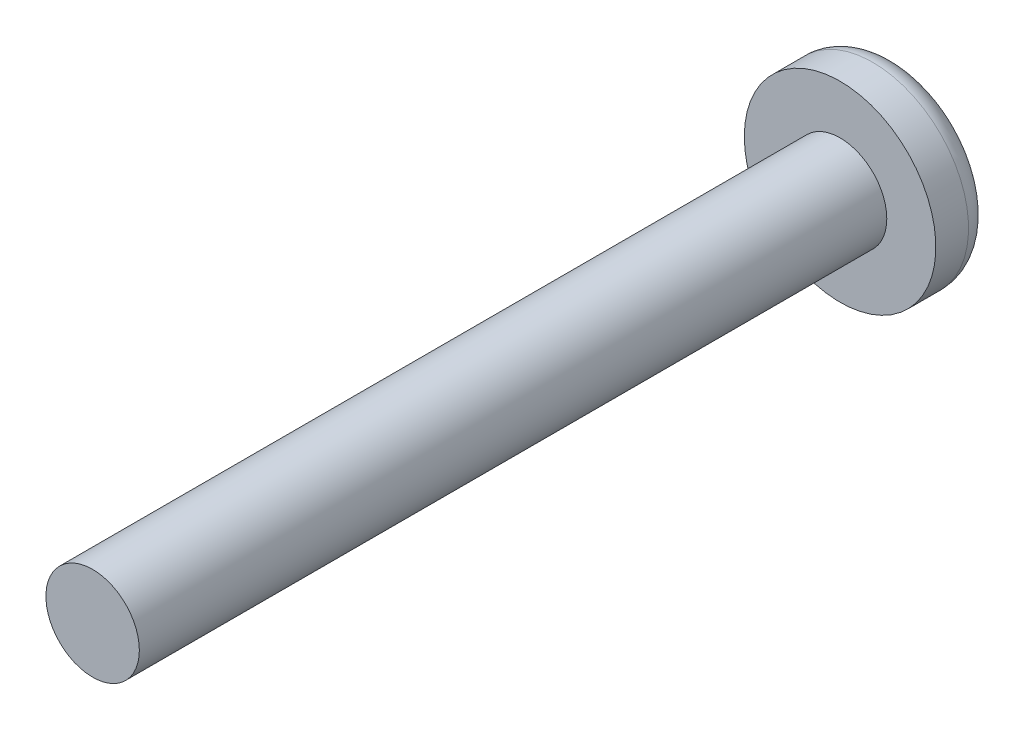
ISO-10303-21;
HEADER;
FILE_DESCRIPTION(('STEP AP214'),'2;1');
FILE_NAME('part.step','',(''),(''),'','','');
FILE_SCHEMA(('AUTOMOTIVE_DESIGN { 1 0 10303 214 1 1 1 1 }'));
ENDSEC;
DATA;
#1=APPLICATION_CONTEXT('core data for automotive mechanical design processes');
#2=APPLICATION_PROTOCOL_DEFINITION('international standard','automotive_design',2000,#1);
#3=PRODUCT_CONTEXT('',#1,'mechanical');
#4=PRODUCT('Part','Part','',(#3));
#5=PRODUCT_RELATED_PRODUCT_CATEGORY('part','',(#4));
#6=PRODUCT_DEFINITION_FORMATION('','',#4);
#7=PRODUCT_DEFINITION_CONTEXT('part definition',#1,'design');
#8=PRODUCT_DEFINITION('design','',#6,#7);
#9=PRODUCT_DEFINITION_SHAPE('','',#8);
#10=(LENGTH_UNIT() NAMED_UNIT(*) SI_UNIT(.MILLI.,.METRE.));
#11=(NAMED_UNIT(*) PLANE_ANGLE_UNIT() SI_UNIT($,.RADIAN.));
#12=(NAMED_UNIT(*) SI_UNIT($,.STERADIAN.) SOLID_ANGLE_UNIT());
#13=UNCERTAINTY_MEASURE_WITH_UNIT(LENGTH_MEASURE(1.E-05),#10,'distance_accuracy_value','');
#14=(GEOMETRIC_REPRESENTATION_CONTEXT(3) GLOBAL_UNCERTAINTY_ASSIGNED_CONTEXT((#13)) GLOBAL_UNIT_ASSIGNED_CONTEXT((#10,
#11,#12)) REPRESENTATION_CONTEXT('',''));
#15=CARTESIAN_POINT('',(0.,0.,0.));
#16=DIRECTION('',(0.,0.,1.));
#17=DIRECTION('',(1.,0.,0.));
#18=AXIS2_PLACEMENT_3D('',#15,#16,#17);
#19=CARTESIAN_POINT('',(0.,0.,16.));
#20=DIRECTION('',(0.,0.,-1.));
#21=DIRECTION('',(-1.,0.,0.));
#22=AXIS2_PLACEMENT_3D('',#19,#20,#21);
#23=CYLINDRICAL_SURFACE('',#22,1.);
#24=CARTESIAN_POINT('',(0.,0.,16.));
#25=DIRECTION('',(0.,0.,1.));
#26=DIRECTION('',(1.,0.,0.));
#27=AXIS2_PLACEMENT_3D('',#24,#25,#26);
#28=CIRCLE('',#27,1.);
#29=CARTESIAN_POINT('',(1.,0.,16.));
#30=VERTEX_POINT('',#29);
#31=EDGE_CURVE('E212',#30,#30,#28,.T.);
#32=ORIENTED_EDGE('',*,*,#31,.F.);
#33=EDGE_LOOP('',(#32));
#34=FACE_BOUND('',#33,.T.);
#35=CARTESIAN_POINT('',(0.,0.,0.));
#36=DIRECTION('',(0.,0.,1.));
#37=DIRECTION('',(1.,0.,0.));
#38=AXIS2_PLACEMENT_3D('',#35,#36,#37);
#39=CIRCLE('',#38,1.);
#40=CARTESIAN_POINT('',(1.,0.,0.));
#41=VERTEX_POINT('',#40);
#42=EDGE_CURVE('E211',#41,#41,#39,.T.);
#43=ORIENTED_EDGE('',*,*,#42,.T.);
#44=EDGE_LOOP('',(#43));
#45=FACE_BOUND('',#44,.T.);
#46=ADVANCED_FACE('F35',(#34,#45),#23,.T.);
#47=CARTESIAN_POINT('',(0.,0.,16.));
#48=DIRECTION('',(0.,0.,1.));
#49=DIRECTION('',(1.,0.,0.));
#50=AXIS2_PLACEMENT_3D('',#47,#48,#49);
#51=PLANE('',#50);
#52=ORIENTED_EDGE('',*,*,#31,.T.);
#53=EDGE_LOOP('',(#52));
#54=FACE_BOUND('',#53,.T.);
#55=ADVANCED_FACE('F235',(#54),#51,.T.);
#56=CARTESIAN_POINT('',(0.,0.,-1.2));
#57=DIRECTION('',(0.,0.,1.));
#58=DIRECTION('',(1.,0.,0.));
#59=AXIS2_PLACEMENT_3D('',#56,#57,#58);
#60=CYLINDRICAL_SURFACE('',#59,2.05);
#61=CARTESIAN_POINT('',(0.,0.,-0.7));
#62=DIRECTION('',(0.,0.,-1.));
#63=DIRECTION('',(-1.,0.,0.));
#64=AXIS2_PLACEMENT_3D('',#61,#62,#63);
#65=CIRCLE('',#64,2.05);
#66=CARTESIAN_POINT('',(-2.05,0.,-0.7));
#67=VERTEX_POINT('',#66);
#68=EDGE_CURVE('E11',#67,#67,#65,.F.);
#69=ORIENTED_EDGE('',*,*,#68,.T.);
#70=EDGE_LOOP('',(#69));
#71=FACE_BOUND('',#70,.T.);
#72=CARTESIAN_POINT('',(0.,0.,0.));
#73=DIRECTION('',(0.,0.,-1.));
#74=DIRECTION('',(-1.,0.,0.));
#75=AXIS2_PLACEMENT_3D('',#72,#73,#74);
#76=CIRCLE('',#75,2.05);
#77=CARTESIAN_POINT('',(-2.05,0.,0.));
#78=VERTEX_POINT('',#77);
#79=EDGE_CURVE('E191',#78,#78,#76,.T.);
#80=ORIENTED_EDGE('',*,*,#79,.T.);
#81=EDGE_LOOP('',(#80));
#82=FACE_BOUND('',#81,.T.);
#83=ADVANCED_FACE('F240',(#71,#82),#60,.T.);
#84=CARTESIAN_POINT('',(0.,0.,-1.2));
#85=DIRECTION('',(0.,0.,-1.));
#86=DIRECTION('',(-1.,0.,0.));
#87=AXIS2_PLACEMENT_3D('',#84,#85,#86);
#88=PLANE('',#87);
#89=DIRECTION('',(1.,0.,0.));
#90=VECTOR('',#89,1.);
#91=CARTESIAN_POINT('',(0.25,1.,-1.2));
#92=LINE('',#91,#90);
#93=CARTESIAN_POINT('',(-0.25,1.,-1.2));
#94=VERTEX_POINT('',#93);
#95=CARTESIAN_POINT('',(0.25,1.,-1.2));
#96=VERTEX_POINT('',#95);
#97=EDGE_CURVE('E50',#94,#96,#92,.T.);
#98=ORIENTED_EDGE('',*,*,#97,.F.);
#99=DIRECTION('',(0.,1.,0.));
#100=VECTOR('',#99,1.);
#101=CARTESIAN_POINT('',(-0.25,0.25,-1.2));
#102=LINE('',#101,#100);
#103=CARTESIAN_POINT('',(-0.25,0.25,-1.2));
#104=VERTEX_POINT('',#103);
#105=EDGE_CURVE('E187',#104,#94,#102,.T.);
#106=ORIENTED_EDGE('',*,*,#105,.F.);
#107=DIRECTION('',(1.,0.,0.));
#108=VECTOR('',#107,1.);
#109=CARTESIAN_POINT('',(-0.25,0.25,-1.2));
#110=LINE('',#109,#108);
#111=CARTESIAN_POINT('',(-1.,0.25,-1.2));
#112=VERTEX_POINT('',#111);
#113=EDGE_CURVE('E185',#112,#104,#110,.T.);
#114=ORIENTED_EDGE('',*,*,#113,.F.);
#115=DIRECTION('',(0.,1.,0.));
#116=VECTOR('',#115,1.);
#117=CARTESIAN_POINT('',(-1.,0.25,-1.2));
#118=LINE('',#117,#116);
#119=CARTESIAN_POINT('',(-1.,-0.25,-1.2));
#120=VERTEX_POINT('',#119);
#121=EDGE_CURVE('E134',#120,#112,#118,.T.);
#122=ORIENTED_EDGE('',*,*,#121,.F.);
#123=DIRECTION('',(-1.,0.,0.));
#124=VECTOR('',#123,1.);
#125=CARTESIAN_POINT('',(-0.25,-0.25,-1.2));
#126=LINE('',#125,#124);
#127=CARTESIAN_POINT('',(-0.25,-0.25,-1.2));
#128=VERTEX_POINT('',#127);
#129=EDGE_CURVE('E181',#128,#120,#126,.T.);
#130=ORIENTED_EDGE('',*,*,#129,.F.);
#131=DIRECTION('',(0.,1.,0.));
#132=VECTOR('',#131,1.);
#133=CARTESIAN_POINT('',(-0.25,-0.25,-1.2));
#134=LINE('',#133,#132);
#135=CARTESIAN_POINT('',(-0.25,-1.,-1.2));
#136=VERTEX_POINT('',#135);
#137=EDGE_CURVE('E178',#136,#128,#134,.T.);
#138=ORIENTED_EDGE('',*,*,#137,.F.);
#139=DIRECTION('',(-1.,0.,0.));
#140=VECTOR('',#139,1.);
#141=CARTESIAN_POINT('',(0.25,-1.,-1.2));
#142=LINE('',#141,#140);
#143=CARTESIAN_POINT('',(0.25,-1.,-1.2));
#144=VERTEX_POINT('',#143);
#145=EDGE_CURVE('E175',#144,#136,#142,.T.);
#146=ORIENTED_EDGE('',*,*,#145,.F.);
#147=DIRECTION('',(0.,-1.,0.));
#148=VECTOR('',#147,1.);
#149=CARTESIAN_POINT('',(0.25,-0.25,-1.2));
#150=LINE('',#149,#148);
#151=CARTESIAN_POINT('',(0.25,-0.25,-1.2));
#152=VERTEX_POINT('',#151);
#153=EDGE_CURVE('E172',#152,#144,#150,.T.);
#154=ORIENTED_EDGE('',*,*,#153,.F.);
#155=DIRECTION('',(-1.,0.,0.));
#156=VECTOR('',#155,1.);
#157=CARTESIAN_POINT('',(0.25,-0.25,-1.2));
#158=LINE('',#157,#156);
#159=CARTESIAN_POINT('',(1.,-0.25,-1.2));
#160=VERTEX_POINT('',#159);
#161=EDGE_CURVE('E169',#160,#152,#158,.T.);
#162=ORIENTED_EDGE('',*,*,#161,.F.);
#163=DIRECTION('',(0.,-1.,0.));
#164=VECTOR('',#163,1.);
#165=CARTESIAN_POINT('',(1.,0.25,-1.2));
#166=LINE('',#165,#164);
#167=CARTESIAN_POINT('',(1.,0.25,-1.2));
#168=VERTEX_POINT('',#167);
#169=EDGE_CURVE('E166',#168,#160,#166,.T.);
#170=ORIENTED_EDGE('',*,*,#169,.F.);
#171=DIRECTION('',(1.,0.,0.));
#172=VECTOR('',#171,1.);
#173=CARTESIAN_POINT('',(0.25,0.25,-1.2));
#174=LINE('',#173,#172);
#175=CARTESIAN_POINT('',(0.25,0.25,-1.2));
#176=VERTEX_POINT('',#175);
#177=EDGE_CURVE('E163',#176,#168,#174,.T.);
#178=ORIENTED_EDGE('',*,*,#177,.F.);
#179=DIRECTION('',(0.,-1.,0.));
#180=VECTOR('',#179,1.);
#181=CARTESIAN_POINT('',(0.25,0.25,-1.2));
#182=LINE('',#181,#180);
#183=EDGE_CURVE('E160',#96,#176,#182,.T.);
#184=ORIENTED_EDGE('',*,*,#183,.F.);
#185=EDGE_LOOP('',(#98,#106,#114,#122,#130,#138,#146,#154,#162,#170,#178,#184));
#186=FACE_BOUND('',#185,.T.);
#187=CARTESIAN_POINT('',(0.,0.,-1.2));
#188=DIRECTION('',(0.,0.,-1.));
#189=DIRECTION('',(-1.,0.,0.));
#190=AXIS2_PLACEMENT_3D('',#187,#188,#189);
#191=CIRCLE('',#190,1.55);
#192=CARTESIAN_POINT('',(-1.55,0.,-1.2));
#193=VERTEX_POINT('',#192);
#194=EDGE_CURVE('E43',#193,#193,#191,.T.);
#195=ORIENTED_EDGE('',*,*,#194,.T.);
#196=EDGE_LOOP('',(#195));
#197=FACE_BOUND('',#196,.T.);
#198=ADVANCED_FACE('F219',(#186,#197),#88,.T.);
#199=CARTESIAN_POINT('',(0.,0.,0.));
#200=DIRECTION('',(0.,0.,-1.));
#201=DIRECTION('',(-1.,0.,0.));
#202=AXIS2_PLACEMENT_3D('',#199,#200,#201);
#203=PLANE('',#202);
#204=ORIENTED_EDGE('',*,*,#42,.F.);
#205=EDGE_LOOP('',(#204));
#206=FACE_BOUND('',#205,.T.);
#207=ORIENTED_EDGE('',*,*,#79,.F.);
#208=EDGE_LOOP('',(#207));
#209=FACE_BOUND('',#208,.T.);
#210=ADVANCED_FACE('F223',(#206,#209),#203,.F.);
#211=CARTESIAN_POINT('',(0.,0.,-0.7));
#212=DIRECTION('',(0.,0.,-1.));
#213=DIRECTION('',(-1.,0.,0.));
#214=AXIS2_PLACEMENT_3D('',#211,#212,#213);
#215=TOROIDAL_SURFACE('',#214,1.55,0.5);
#216=ORIENTED_EDGE('',*,*,#68,.F.);
#217=EDGE_LOOP('',(#216));
#218=FACE_BOUND('',#217,.T.);
#219=ORIENTED_EDGE('',*,*,#194,.F.);
#220=EDGE_LOOP('',(#219));
#221=FACE_BOUND('',#220,.T.);
#222=ADVANCED_FACE('F37',(#218,#221),#215,.T.);
#223=CARTESIAN_POINT('',(0.25,1.,-0.7));
#224=DIRECTION('',(0.,1.,0.));
#225=DIRECTION('',(0.,0.,1.));
#226=AXIS2_PLACEMENT_3D('',#223,#224,#225);
#227=PLANE('',#226);
#228=ORIENTED_EDGE('',*,*,#97,.T.);
#229=DIRECTION('',(0.,0.,-1.));
#230=VECTOR('',#229,1.);
#231=CARTESIAN_POINT('',(0.25,1.,-0.7));
#232=LINE('',#231,#230);
#233=CARTESIAN_POINT('',(0.25,1.,-0.7));
#234=VERTEX_POINT('',#233);
#235=EDGE_CURVE('E98',#234,#96,#232,.T.);
#236=ORIENTED_EDGE('',*,*,#235,.F.);
#237=DIRECTION('',(1.,0.,0.));
#238=VECTOR('',#237,1.);
#239=CARTESIAN_POINT('',(0.25,1.,-0.7));
#240=LINE('',#239,#238);
#241=CARTESIAN_POINT('',(-0.25,1.,-0.7));
#242=VERTEX_POINT('',#241);
#243=EDGE_CURVE('E189',#242,#234,#240,.T.);
#244=ORIENTED_EDGE('',*,*,#243,.F.);
#245=DIRECTION('',(0.,0.,-1.));
#246=VECTOR('',#245,1.);
#247=CARTESIAN_POINT('',(-0.25,1.,-0.7));
#248=LINE('',#247,#246);
#249=EDGE_CURVE('E58',#242,#94,#248,.T.);
#250=ORIENTED_EDGE('',*,*,#249,.T.);
#251=EDGE_LOOP('',(#228,#236,#244,#250));
#252=FACE_BOUND('',#251,.T.);
#253=ADVANCED_FACE('F222',(#252),#227,.F.);
#254=CARTESIAN_POINT('',(-0.25,0.25,-0.7));
#255=DIRECTION('',(-1.,0.,0.));
#256=DIRECTION('',(0.,-1.,0.));
#257=AXIS2_PLACEMENT_3D('',#254,#255,#256);
#258=PLANE('',#257);
#259=ORIENTED_EDGE('',*,*,#105,.T.);
#260=ORIENTED_EDGE('',*,*,#249,.F.);
#261=DIRECTION('',(0.,1.,0.));
#262=VECTOR('',#261,1.);
#263=CARTESIAN_POINT('',(-0.25,0.25,-0.7));
#264=LINE('',#263,#262);
#265=CARTESIAN_POINT('',(-0.25,0.25,-0.7));
#266=VERTEX_POINT('',#265);
#267=EDGE_CURVE('E146',#266,#242,#264,.T.);
#268=ORIENTED_EDGE('',*,*,#267,.F.);
#269=DIRECTION('',(0.,0.,-1.));
#270=VECTOR('',#269,1.);
#271=CARTESIAN_POINT('',(-0.25,0.25,-0.7));
#272=LINE('',#271,#270);
#273=EDGE_CURVE('E138',#266,#104,#272,.T.);
#274=ORIENTED_EDGE('',*,*,#273,.T.);
#275=EDGE_LOOP('',(#259,#260,#268,#274));
#276=FACE_BOUND('',#275,.T.);
#277=ADVANCED_FACE('F229',(#276),#258,.F.);
#278=CARTESIAN_POINT('',(-0.25,0.25,-0.7));
#279=DIRECTION('',(0.,1.,0.));
#280=DIRECTION('',(-1.,0.,0.));
#281=AXIS2_PLACEMENT_3D('',#278,#279,#280);
#282=PLANE('',#281);
#283=ORIENTED_EDGE('',*,*,#113,.T.);
#284=ORIENTED_EDGE('',*,*,#273,.F.);
#285=DIRECTION('',(1.,0.,0.));
#286=VECTOR('',#285,1.);
#287=CARTESIAN_POINT('',(-0.25,0.25,-0.7));
#288=LINE('',#287,#286);
#289=CARTESIAN_POINT('',(-1.,0.25,-0.7));
#290=VERTEX_POINT('',#289);
#291=EDGE_CURVE('E142',#290,#266,#288,.T.);
#292=ORIENTED_EDGE('',*,*,#291,.F.);
#293=DIRECTION('',(0.,0.,-1.));
#294=VECTOR('',#293,1.);
#295=CARTESIAN_POINT('',(-1.,0.25,-0.7));
#296=LINE('',#295,#294);
#297=EDGE_CURVE('E127',#290,#112,#296,.T.);
#298=ORIENTED_EDGE('',*,*,#297,.T.);
#299=EDGE_LOOP('',(#283,#284,#292,#298));
#300=FACE_BOUND('',#299,.T.);
#301=ADVANCED_FACE('F143',(#300),#282,.F.);
#302=CARTESIAN_POINT('',(-1.,0.25,-0.7));
#303=DIRECTION('',(-1.,0.,0.));
#304=DIRECTION('',(0.,0.,1.));
#305=AXIS2_PLACEMENT_3D('',#302,#303,#304);
#306=PLANE('',#305);
#307=ORIENTED_EDGE('',*,*,#121,.T.);
#308=ORIENTED_EDGE('',*,*,#297,.F.);
#309=DIRECTION('',(0.,1.,0.));
#310=VECTOR('',#309,1.);
#311=CARTESIAN_POINT('',(-1.,0.25,-0.7));
#312=LINE('',#311,#310);
#313=CARTESIAN_POINT('',(-1.,-0.25,-0.7));
#314=VERTEX_POINT('',#313);
#315=EDGE_CURVE('E131',#314,#290,#312,.T.);
#316=ORIENTED_EDGE('',*,*,#315,.F.);
#317=DIRECTION('',(0.,0.,-1.));
#318=VECTOR('',#317,1.);
#319=CARTESIAN_POINT('',(-1.,-0.25,-0.7));
#320=LINE('',#319,#318);
#321=EDGE_CURVE('E139',#314,#120,#320,.T.);
#322=ORIENTED_EDGE('',*,*,#321,.T.);
#323=EDGE_LOOP('',(#307,#308,#316,#322));
#324=FACE_BOUND('',#323,.T.);
#325=ADVANCED_FACE('F129',(#324),#306,.F.);
#326=CARTESIAN_POINT('',(-0.25,-0.25,-0.7));
#327=DIRECTION('',(0.,-1.,0.));
#328=DIRECTION('',(1.,0.,0.));
#329=AXIS2_PLACEMENT_3D('',#326,#327,#328);
#330=PLANE('',#329);
#331=ORIENTED_EDGE('',*,*,#129,.T.);
#332=ORIENTED_EDGE('',*,*,#321,.F.);
#333=DIRECTION('',(-1.,0.,0.));
#334=VECTOR('',#333,1.);
#335=CARTESIAN_POINT('',(-0.25,-0.25,-0.7));
#336=LINE('',#335,#334);
#337=CARTESIAN_POINT('',(-0.25,-0.25,-0.7));
#338=VERTEX_POINT('',#337);
#339=EDGE_CURVE('E152',#338,#314,#336,.T.);
#340=ORIENTED_EDGE('',*,*,#339,.F.);
#341=DIRECTION('',(0.,0.,-1.));
#342=VECTOR('',#341,1.);
#343=CARTESIAN_POINT('',(-0.25,-0.25,-0.7));
#344=LINE('',#343,#342);
#345=EDGE_CURVE('E194',#338,#128,#344,.T.);
#346=ORIENTED_EDGE('',*,*,#345,.T.);
#347=EDGE_LOOP('',(#331,#332,#340,#346));
#348=FACE_BOUND('',#347,.T.);
#349=ADVANCED_FACE('F279',(#348),#330,.F.);
#350=CARTESIAN_POINT('',(-0.25,-0.25,-0.7));
#351=DIRECTION('',(-1.,0.,0.));
#352=DIRECTION('',(0.,-1.,0.));
#353=AXIS2_PLACEMENT_3D('',#350,#351,#352);
#354=PLANE('',#353);
#355=ORIENTED_EDGE('',*,*,#137,.T.);
#356=ORIENTED_EDGE('',*,*,#345,.F.);
#357=DIRECTION('',(0.,1.,0.));
#358=VECTOR('',#357,1.);
#359=CARTESIAN_POINT('',(-0.25,-0.25,-0.7));
#360=LINE('',#359,#358);
#361=CARTESIAN_POINT('',(-0.25,-1.,-0.7));
#362=VERTEX_POINT('',#361);
#363=EDGE_CURVE('E154',#362,#338,#360,.T.);
#364=ORIENTED_EDGE('',*,*,#363,.F.);
#365=DIRECTION('',(0.,0.,-1.));
#366=VECTOR('',#365,1.);
#367=CARTESIAN_POINT('',(-0.25,-1.,-0.7));
#368=LINE('',#367,#366);
#369=EDGE_CURVE('E196',#362,#136,#368,.T.);
#370=ORIENTED_EDGE('',*,*,#369,.T.);
#371=EDGE_LOOP('',(#355,#356,#364,#370));
#372=FACE_BOUND('',#371,.T.);
#373=ADVANCED_FACE('F275',(#372),#354,.F.);
#374=CARTESIAN_POINT('',(0.25,-1.,-0.7));
#375=DIRECTION('',(0.,-1.,0.));
#376=DIRECTION('',(0.,0.,-1.));
#377=AXIS2_PLACEMENT_3D('',#374,#375,#376);
#378=PLANE('',#377);
#379=ORIENTED_EDGE('',*,*,#145,.T.);
#380=ORIENTED_EDGE('',*,*,#369,.F.);
#381=DIRECTION('',(-1.,0.,0.));
#382=VECTOR('',#381,1.);
#383=CARTESIAN_POINT('',(0.25,-1.,-0.7));
#384=LINE('',#383,#382);
#385=CARTESIAN_POINT('',(0.25,-1.,-0.7));
#386=VERTEX_POINT('',#385);
#387=EDGE_CURVE('E423',#386,#362,#384,.T.);
#388=ORIENTED_EDGE('',*,*,#387,.F.);
#389=DIRECTION('',(0.,0.,-1.));
#390=VECTOR('',#389,1.);
#391=CARTESIAN_POINT('',(0.25,-1.,-0.7));
#392=LINE('',#391,#390);
#393=EDGE_CURVE('E198',#386,#144,#392,.T.);
#394=ORIENTED_EDGE('',*,*,#393,.T.);
#395=EDGE_LOOP('',(#379,#380,#388,#394));
#396=FACE_BOUND('',#395,.T.);
#397=ADVANCED_FACE('F271',(#396),#378,.F.);
#398=CARTESIAN_POINT('',(0.25,-0.25,-0.7));
#399=DIRECTION('',(1.,0.,0.));
#400=DIRECTION('',(0.,1.,0.));
#401=AXIS2_PLACEMENT_3D('',#398,#399,#400);
#402=PLANE('',#401);
#403=ORIENTED_EDGE('',*,*,#153,.T.);
#404=ORIENTED_EDGE('',*,*,#393,.F.);
#405=DIRECTION('',(0.,-1.,0.));
#406=VECTOR('',#405,1.);
#407=CARTESIAN_POINT('',(0.25,-0.25,-0.7));
#408=LINE('',#407,#406);
#409=CARTESIAN_POINT('',(0.25,-0.25,-0.7));
#410=VERTEX_POINT('',#409);
#411=EDGE_CURVE('E420',#410,#386,#408,.T.);
#412=ORIENTED_EDGE('',*,*,#411,.F.);
#413=DIRECTION('',(0.,0.,-1.));
#414=VECTOR('',#413,1.);
#415=CARTESIAN_POINT('',(0.25,-0.25,-0.7));
#416=LINE('',#415,#414);
#417=EDGE_CURVE('E200',#410,#152,#416,.T.);
#418=ORIENTED_EDGE('',*,*,#417,.T.);
#419=EDGE_LOOP('',(#403,#404,#412,#418));
#420=FACE_BOUND('',#419,.T.);
#421=ADVANCED_FACE('F267',(#420),#402,.F.);
#422=CARTESIAN_POINT('',(0.25,-0.25,-0.7));
#423=DIRECTION('',(0.,-1.,0.));
#424=DIRECTION('',(1.,0.,0.));
#425=AXIS2_PLACEMENT_3D('',#422,#423,#424);
#426=PLANE('',#425);
#427=ORIENTED_EDGE('',*,*,#161,.T.);
#428=ORIENTED_EDGE('',*,*,#417,.F.);
#429=DIRECTION('',(-1.,0.,0.));
#430=VECTOR('',#429,1.);
#431=CARTESIAN_POINT('',(0.25,-0.25,-0.7));
#432=LINE('',#431,#430);
#433=CARTESIAN_POINT('',(1.,-0.25,-0.7));
#434=VERTEX_POINT('',#433);
#435=EDGE_CURVE('E417',#434,#410,#432,.T.);
#436=ORIENTED_EDGE('',*,*,#435,.F.);
#437=DIRECTION('',(0.,0.,-1.));
#438=VECTOR('',#437,1.);
#439=CARTESIAN_POINT('',(1.,-0.25,-0.7));
#440=LINE('',#439,#438);
#441=EDGE_CURVE('E202',#434,#160,#440,.T.);
#442=ORIENTED_EDGE('',*,*,#441,.T.);
#443=EDGE_LOOP('',(#427,#428,#436,#442));
#444=FACE_BOUND('',#443,.T.);
#445=ADVANCED_FACE('F263',(#444),#426,.F.);
#446=CARTESIAN_POINT('',(1.,0.25,-0.7));
#447=DIRECTION('',(1.,0.,0.));
#448=DIRECTION('',(0.,0.,-1.));
#449=AXIS2_PLACEMENT_3D('',#446,#447,#448);
#450=PLANE('',#449);
#451=ORIENTED_EDGE('',*,*,#169,.T.);
#452=ORIENTED_EDGE('',*,*,#441,.F.);
#453=DIRECTION('',(0.,-1.,0.));
#454=VECTOR('',#453,1.);
#455=CARTESIAN_POINT('',(1.,0.25,-0.7));
#456=LINE('',#455,#454);
#457=CARTESIAN_POINT('',(1.,0.25,-0.7));
#458=VERTEX_POINT('',#457);
#459=EDGE_CURVE('E414',#458,#434,#456,.T.);
#460=ORIENTED_EDGE('',*,*,#459,.F.);
#461=DIRECTION('',(0.,0.,-1.));
#462=VECTOR('',#461,1.);
#463=CARTESIAN_POINT('',(1.,0.25,-0.7));
#464=LINE('',#463,#462);
#465=EDGE_CURVE('E204',#458,#168,#464,.T.);
#466=ORIENTED_EDGE('',*,*,#465,.T.);
#467=EDGE_LOOP('',(#451,#452,#460,#466));
#468=FACE_BOUND('',#467,.T.);
#469=ADVANCED_FACE('F259',(#468),#450,.F.);
#470=CARTESIAN_POINT('',(0.25,0.25,-0.7));
#471=DIRECTION('',(0.,1.,0.));
#472=DIRECTION('',(-1.,0.,0.));
#473=AXIS2_PLACEMENT_3D('',#470,#471,#472);
#474=PLANE('',#473);
#475=ORIENTED_EDGE('',*,*,#177,.T.);
#476=ORIENTED_EDGE('',*,*,#465,.F.);
#477=DIRECTION('',(1.,0.,0.));
#478=VECTOR('',#477,1.);
#479=CARTESIAN_POINT('',(0.25,0.25,-0.7));
#480=LINE('',#479,#478);
#481=CARTESIAN_POINT('',(0.25,0.25,-0.7));
#482=VERTEX_POINT('',#481);
#483=EDGE_CURVE('E409',#482,#458,#480,.T.);
#484=ORIENTED_EDGE('',*,*,#483,.F.);
#485=DIRECTION('',(0.,0.,-1.));
#486=VECTOR('',#485,1.);
#487=CARTESIAN_POINT('',(0.25,0.25,-0.7));
#488=LINE('',#487,#486);
#489=EDGE_CURVE('E206',#482,#176,#488,.T.);
#490=ORIENTED_EDGE('',*,*,#489,.T.);
#491=EDGE_LOOP('',(#475,#476,#484,#490));
#492=FACE_BOUND('',#491,.T.);
#493=ADVANCED_FACE('F255',(#492),#474,.F.);
#494=CARTESIAN_POINT('',(0.25,0.25,-0.7));
#495=DIRECTION('',(1.,0.,0.));
#496=DIRECTION('',(0.,1.,0.));
#497=AXIS2_PLACEMENT_3D('',#494,#495,#496);
#498=PLANE('',#497);
#499=ORIENTED_EDGE('',*,*,#183,.T.);
#500=ORIENTED_EDGE('',*,*,#489,.F.);
#501=DIRECTION('',(0.,-1.,0.));
#502=VECTOR('',#501,1.);
#503=CARTESIAN_POINT('',(0.25,0.25,-0.7));
#504=LINE('',#503,#502);
#505=EDGE_CURVE('E407',#234,#482,#504,.T.);
#506=ORIENTED_EDGE('',*,*,#505,.F.);
#507=ORIENTED_EDGE('',*,*,#235,.T.);
#508=EDGE_LOOP('',(#499,#500,#506,#507));
#509=FACE_BOUND('',#508,.T.);
#510=ADVANCED_FACE('F252',(#509),#498,.F.);
#511=CARTESIAN_POINT('',(0.,0.,-0.7));
#512=DIRECTION('',(0.,0.,-1.));
#513=DIRECTION('',(-1.,0.,0.));
#514=AXIS2_PLACEMENT_3D('',#511,#512,#513);
#515=PLANE('',#514);
#516=ORIENTED_EDGE('',*,*,#243,.T.);
#517=ORIENTED_EDGE('',*,*,#505,.T.);
#518=ORIENTED_EDGE('',*,*,#483,.T.);
#519=ORIENTED_EDGE('',*,*,#459,.T.);
#520=ORIENTED_EDGE('',*,*,#435,.T.);
#521=ORIENTED_EDGE('',*,*,#411,.T.);
#522=ORIENTED_EDGE('',*,*,#387,.T.);
#523=ORIENTED_EDGE('',*,*,#363,.T.);
#524=ORIENTED_EDGE('',*,*,#339,.T.);
#525=ORIENTED_EDGE('',*,*,#315,.T.);
#526=ORIENTED_EDGE('',*,*,#291,.T.);
#527=ORIENTED_EDGE('',*,*,#267,.T.);
#528=EDGE_LOOP('',(#516,#517,#518,#519,#520,#521,#522,#523,#524,#525,#526,#527));
#529=FACE_BOUND('',#528,.T.);
#530=ADVANCED_FACE('F149',(#529),#515,.T.);
#531=CLOSED_SHELL('',(#46,#55,#83,#198,#210,#222,#253,#277,#301,#325,#349,#373,#397,#421,#445,
#469,#493,#510,#530));
#532=MANIFOLD_SOLID_BREP('B2',#531);
#533=ADVANCED_BREP_SHAPE_REPRESENTATION('',(#18,#532),#14);
#534=SHAPE_DEFINITION_REPRESENTATION(#9,#533);
ENDSEC;
END-ISO-10303-21;
